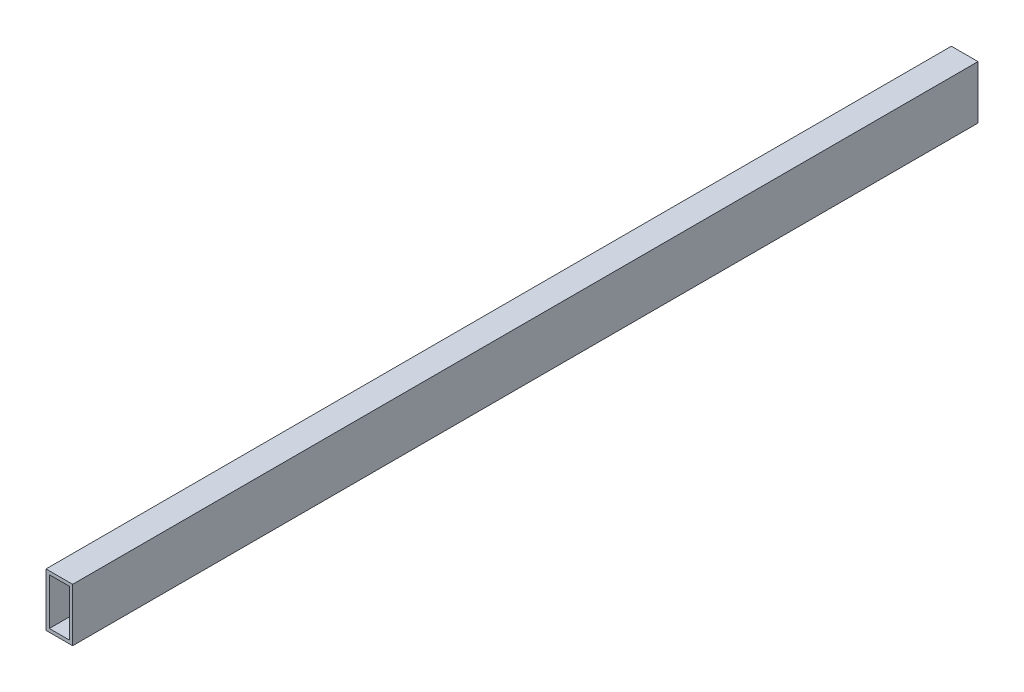
ISO-10303-21;
HEADER;
FILE_DESCRIPTION(('STEP AP214'),'2;1');
FILE_NAME('part.step','',(''),(''),'','','');
FILE_SCHEMA(('AUTOMOTIVE_DESIGN { 1 0 10303 214 1 1 1 1 }'));
ENDSEC;
DATA;
#1=APPLICATION_CONTEXT('core data for automotive mechanical design processes');
#2=APPLICATION_PROTOCOL_DEFINITION('international standard','automotive_design',2000,#1);
#3=PRODUCT_CONTEXT('',#1,'mechanical');
#4=PRODUCT('Part','Part','',(#3));
#5=PRODUCT_RELATED_PRODUCT_CATEGORY('part','',(#4));
#6=PRODUCT_DEFINITION_FORMATION('','',#4);
#7=PRODUCT_DEFINITION_CONTEXT('part definition',#1,'design');
#8=PRODUCT_DEFINITION('design','',#6,#7);
#9=PRODUCT_DEFINITION_SHAPE('','',#8);
#10=(LENGTH_UNIT() NAMED_UNIT(*) SI_UNIT(.MILLI.,.METRE.));
#11=(NAMED_UNIT(*) PLANE_ANGLE_UNIT() SI_UNIT($,.RADIAN.));
#12=(NAMED_UNIT(*) SI_UNIT($,.STERADIAN.) SOLID_ANGLE_UNIT());
#13=UNCERTAINTY_MEASURE_WITH_UNIT(LENGTH_MEASURE(1.E-05),#10,'distance_accuracy_value','');
#14=(GEOMETRIC_REPRESENTATION_CONTEXT(3) GLOBAL_UNCERTAINTY_ASSIGNED_CONTEXT((#13)) GLOBAL_UNIT_ASSIGNED_CONTEXT((#10,
#11,#12)) REPRESENTATION_CONTEXT('',''));
#15=CARTESIAN_POINT('',(0.,0.,0.));
#16=DIRECTION('',(0.,0.,1.));
#17=DIRECTION('',(1.,0.,0.));
#18=AXIS2_PLACEMENT_3D('',#15,#16,#17);
#19=CARTESIAN_POINT('',(0.,0.,431.8));
#20=DIRECTION('',(0.,0.,-1.));
#21=DIRECTION('',(-1.,0.,0.));
#22=AXIS2_PLACEMENT_3D('',#19,#20,#21);
#23=PLANE('',#22);
#24=DIRECTION('',(0.,-1.,0.));
#25=VECTOR('',#24,1.);
#26=CARTESIAN_POINT('',(0.,0.,431.8));
#27=LINE('',#26,#25);
#28=CARTESIAN_POINT('',(0.,25.4,431.8));
#29=VERTEX_POINT('',#28);
#30=CARTESIAN_POINT('',(0.,0.,431.8));
#31=VERTEX_POINT('',#30);
#32=EDGE_CURVE('E153',#29,#31,#27,.T.);
#33=ORIENTED_EDGE('',*,*,#32,.T.);
#34=DIRECTION('',(1.,0.,0.));
#35=VECTOR('',#34,1.);
#36=CARTESIAN_POINT('',(0.,0.,431.8));
#37=LINE('',#36,#35);
#38=CARTESIAN_POINT('',(12.7,0.,431.8));
#39=VERTEX_POINT('',#38);
#40=EDGE_CURVE('E157',#31,#39,#37,.T.);
#41=ORIENTED_EDGE('',*,*,#40,.T.);
#42=DIRECTION('',(0.,1.,0.));
#43=VECTOR('',#42,1.);
#44=CARTESIAN_POINT('',(12.7,0.,431.8));
#45=LINE('',#44,#43);
#46=CARTESIAN_POINT('',(12.7,25.4,431.8));
#47=VERTEX_POINT('',#46);
#48=EDGE_CURVE('E161',#39,#47,#45,.T.);
#49=ORIENTED_EDGE('',*,*,#48,.T.);
#50=DIRECTION('',(-1.,0.,0.));
#51=VECTOR('',#50,1.);
#52=CARTESIAN_POINT('',(0.,25.4,431.8));
#53=LINE('',#52,#51);
#54=EDGE_CURVE('E164',#47,#29,#53,.T.);
#55=ORIENTED_EDGE('',*,*,#54,.T.);
#56=EDGE_LOOP('',(#33,#41,#49,#55));
#57=FACE_BOUND('',#56,.T.);
#58=DIRECTION('',(0.,-1.,0.));
#59=VECTOR('',#58,1.);
#60=CARTESIAN_POINT('',(1.5875,1.5875,431.8));
#61=LINE('',#60,#59);
#62=CARTESIAN_POINT('',(1.5875,23.8125,431.8));
#63=VERTEX_POINT('',#62);
#64=CARTESIAN_POINT('',(1.5875,1.5875,431.8));
#65=VERTEX_POINT('',#64);
#66=EDGE_CURVE('E105',#63,#65,#61,.T.);
#67=ORIENTED_EDGE('',*,*,#66,.F.);
#68=DIRECTION('',(-1.,0.,0.));
#69=VECTOR('',#68,1.);
#70=CARTESIAN_POINT('',(1.5875,23.8125,431.8));
#71=LINE('',#70,#69);
#72=CARTESIAN_POINT('',(11.1125,23.8125,431.8));
#73=VERTEX_POINT('',#72);
#74=EDGE_CURVE('E131',#73,#63,#71,.T.);
#75=ORIENTED_EDGE('',*,*,#74,.F.);
#76=DIRECTION('',(0.,1.,0.));
#77=VECTOR('',#76,1.);
#78=CARTESIAN_POINT('',(11.1125,1.5875,431.8));
#79=LINE('',#78,#77);
#80=CARTESIAN_POINT('',(11.1125,1.5875,431.8));
#81=VERTEX_POINT('',#80);
#82=EDGE_CURVE('E127',#81,#73,#79,.T.);
#83=ORIENTED_EDGE('',*,*,#82,.F.);
#84=DIRECTION('',(1.,0.,0.));
#85=VECTOR('',#84,1.);
#86=CARTESIAN_POINT('',(1.5875,1.5875,431.8));
#87=LINE('',#86,#85);
#88=EDGE_CURVE('E114',#65,#81,#87,.T.);
#89=ORIENTED_EDGE('',*,*,#88,.F.);
#90=EDGE_LOOP('',(#67,#75,#83,#89));
#91=FACE_BOUND('',#90,.T.);
#92=ADVANCED_FACE('F39',(#57,#91),#23,.F.);
#93=CARTESIAN_POINT('',(0.,0.,0.));
#94=DIRECTION('',(0.,0.,-1.));
#95=DIRECTION('',(-1.,0.,0.));
#96=AXIS2_PLACEMENT_3D('',#93,#94,#95);
#97=PLANE('',#96);
#98=DIRECTION('',(0.,-1.,0.));
#99=VECTOR('',#98,1.);
#100=CARTESIAN_POINT('',(0.,0.,0.));
#101=LINE('',#100,#99);
#102=CARTESIAN_POINT('',(0.,25.4,0.));
#103=VERTEX_POINT('',#102);
#104=CARTESIAN_POINT('',(0.,0.,0.));
#105=VERTEX_POINT('',#104);
#106=EDGE_CURVE('E123',#103,#105,#101,.T.);
#107=ORIENTED_EDGE('',*,*,#106,.F.);
#108=DIRECTION('',(-1.,0.,0.));
#109=VECTOR('',#108,1.);
#110=CARTESIAN_POINT('',(0.,25.4,0.));
#111=LINE('',#110,#109);
#112=CARTESIAN_POINT('',(12.7,25.4,0.));
#113=VERTEX_POINT('',#112);
#114=EDGE_CURVE('E158',#113,#103,#111,.T.);
#115=ORIENTED_EDGE('',*,*,#114,.F.);
#116=DIRECTION('',(0.,1.,0.));
#117=VECTOR('',#116,1.);
#118=CARTESIAN_POINT('',(12.7,0.,0.));
#119=LINE('',#118,#117);
#120=CARTESIAN_POINT('',(12.7,0.,0.));
#121=VERTEX_POINT('',#120);
#122=EDGE_CURVE('E174',#121,#113,#119,.T.);
#123=ORIENTED_EDGE('',*,*,#122,.F.);
#124=DIRECTION('',(1.,0.,0.));
#125=VECTOR('',#124,1.);
#126=CARTESIAN_POINT('',(0.,0.,0.));
#127=LINE('',#126,#125);
#128=EDGE_CURVE('E171',#105,#121,#127,.T.);
#129=ORIENTED_EDGE('',*,*,#128,.F.);
#130=EDGE_LOOP('',(#107,#115,#123,#129));
#131=FACE_BOUND('',#130,.T.);
#132=DIRECTION('',(-1.,0.,0.));
#133=VECTOR('',#132,1.);
#134=CARTESIAN_POINT('',(1.5875,23.8125,0.));
#135=LINE('',#134,#133);
#136=CARTESIAN_POINT('',(11.1125,23.8125,0.));
#137=VERTEX_POINT('',#136);
#138=CARTESIAN_POINT('',(1.5875,23.8125,0.));
#139=VERTEX_POINT('',#138);
#140=EDGE_CURVE('E115',#137,#139,#135,.T.);
#141=ORIENTED_EDGE('',*,*,#140,.T.);
#142=DIRECTION('',(0.,-1.,0.));
#143=VECTOR('',#142,1.);
#144=CARTESIAN_POINT('',(1.5875,1.5875,0.));
#145=LINE('',#144,#143);
#146=CARTESIAN_POINT('',(1.5875,1.5875,0.));
#147=VERTEX_POINT('',#146);
#148=EDGE_CURVE('E63',#139,#147,#145,.T.);
#149=ORIENTED_EDGE('',*,*,#148,.T.);
#150=DIRECTION('',(1.,0.,0.));
#151=VECTOR('',#150,1.);
#152=CARTESIAN_POINT('',(1.5875,1.5875,0.));
#153=LINE('',#152,#151);
#154=CARTESIAN_POINT('',(11.1125,1.5875,0.));
#155=VERTEX_POINT('',#154);
#156=EDGE_CURVE('E121',#147,#155,#153,.T.);
#157=ORIENTED_EDGE('',*,*,#156,.T.);
#158=DIRECTION('',(0.,1.,0.));
#159=VECTOR('',#158,1.);
#160=CARTESIAN_POINT('',(11.1125,1.5875,0.));
#161=LINE('',#160,#159);
#162=EDGE_CURVE('E140',#155,#137,#161,.T.);
#163=ORIENTED_EDGE('',*,*,#162,.T.);
#164=EDGE_LOOP('',(#141,#149,#157,#163));
#165=FACE_BOUND('',#164,.T.);
#166=ADVANCED_FACE('F197',(#131,#165),#97,.T.);
#167=CARTESIAN_POINT('',(0.,0.,431.8));
#168=DIRECTION('',(1.,0.,0.));
#169=DIRECTION('',(0.,0.,-1.));
#170=AXIS2_PLACEMENT_3D('',#167,#168,#169);
#171=PLANE('',#170);
#172=ORIENTED_EDGE('',*,*,#106,.T.);
#173=DIRECTION('',(0.,0.,-1.));
#174=VECTOR('',#173,1.);
#175=CARTESIAN_POINT('',(0.,0.,431.8));
#176=LINE('',#175,#174);
#177=EDGE_CURVE('E11',#31,#105,#176,.T.);
#178=ORIENTED_EDGE('',*,*,#177,.F.);
#179=ORIENTED_EDGE('',*,*,#32,.F.);
#180=DIRECTION('',(0.,0.,-1.));
#181=VECTOR('',#180,1.);
#182=CARTESIAN_POINT('',(0.,25.4,431.8));
#183=LINE('',#182,#181);
#184=EDGE_CURVE('E167',#29,#103,#183,.T.);
#185=ORIENTED_EDGE('',*,*,#184,.T.);
#186=EDGE_LOOP('',(#172,#178,#179,#185));
#187=FACE_BOUND('',#186,.T.);
#188=ADVANCED_FACE('F41',(#187),#171,.F.);
#189=CARTESIAN_POINT('',(0.,0.,431.8));
#190=DIRECTION('',(0.,1.,0.));
#191=DIRECTION('',(0.,0.,1.));
#192=AXIS2_PLACEMENT_3D('',#189,#190,#191);
#193=PLANE('',#192);
#194=ORIENTED_EDGE('',*,*,#128,.T.);
#195=DIRECTION('',(0.,0.,-1.));
#196=VECTOR('',#195,1.);
#197=CARTESIAN_POINT('',(12.7,0.,431.8));
#198=LINE('',#197,#196);
#199=EDGE_CURVE('E48',#39,#121,#198,.T.);
#200=ORIENTED_EDGE('',*,*,#199,.F.);
#201=ORIENTED_EDGE('',*,*,#40,.F.);
#202=ORIENTED_EDGE('',*,*,#177,.T.);
#203=EDGE_LOOP('',(#194,#200,#201,#202));
#204=FACE_BOUND('',#203,.T.);
#205=ADVANCED_FACE('F207',(#204),#193,.F.);
#206=CARTESIAN_POINT('',(12.7,0.,431.8));
#207=DIRECTION('',(-1.,0.,0.));
#208=DIRECTION('',(0.,0.,1.));
#209=AXIS2_PLACEMENT_3D('',#206,#207,#208);
#210=PLANE('',#209);
#211=ORIENTED_EDGE('',*,*,#122,.T.);
#212=DIRECTION('',(0.,0.,-1.));
#213=VECTOR('',#212,1.);
#214=CARTESIAN_POINT('',(12.7,25.4,431.8));
#215=LINE('',#214,#213);
#216=EDGE_CURVE('E182',#47,#113,#215,.T.);
#217=ORIENTED_EDGE('',*,*,#216,.F.);
#218=ORIENTED_EDGE('',*,*,#48,.F.);
#219=ORIENTED_EDGE('',*,*,#199,.T.);
#220=EDGE_LOOP('',(#211,#217,#218,#219));
#221=FACE_BOUND('',#220,.T.);
#222=ADVANCED_FACE('F191',(#221),#210,.F.);
#223=CARTESIAN_POINT('',(0.,25.4,431.8));
#224=DIRECTION('',(0.,-1.,0.));
#225=DIRECTION('',(0.,0.,-1.));
#226=AXIS2_PLACEMENT_3D('',#223,#224,#225);
#227=PLANE('',#226);
#228=ORIENTED_EDGE('',*,*,#114,.T.);
#229=ORIENTED_EDGE('',*,*,#184,.F.);
#230=ORIENTED_EDGE('',*,*,#54,.F.);
#231=ORIENTED_EDGE('',*,*,#216,.T.);
#232=EDGE_LOOP('',(#228,#229,#230,#231));
#233=FACE_BOUND('',#232,.T.);
#234=ADVANCED_FACE('F201',(#233),#227,.F.);
#235=CARTESIAN_POINT('',(1.5875,1.5875,431.8));
#236=DIRECTION('',(1.,0.,0.));
#237=DIRECTION('',(0.,0.,-1.));
#238=AXIS2_PLACEMENT_3D('',#235,#236,#237);
#239=PLANE('',#238);
#240=ORIENTED_EDGE('',*,*,#148,.F.);
#241=DIRECTION('',(0.,0.,-1.));
#242=VECTOR('',#241,1.);
#243=CARTESIAN_POINT('',(1.5875,23.8125,431.8));
#244=LINE('',#243,#242);
#245=EDGE_CURVE('E109',#63,#139,#244,.T.);
#246=ORIENTED_EDGE('',*,*,#245,.F.);
#247=ORIENTED_EDGE('',*,*,#66,.T.);
#248=DIRECTION('',(0.,0.,-1.));
#249=VECTOR('',#248,1.);
#250=CARTESIAN_POINT('',(1.5875,1.5875,431.8));
#251=LINE('',#250,#249);
#252=EDGE_CURVE('E108',#65,#147,#251,.T.);
#253=ORIENTED_EDGE('',*,*,#252,.T.);
#254=EDGE_LOOP('',(#240,#246,#247,#253));
#255=FACE_BOUND('',#254,.T.);
#256=ADVANCED_FACE('F107',(#255),#239,.T.);
#257=CARTESIAN_POINT('',(1.5875,1.5875,431.8));
#258=DIRECTION('',(0.,1.,0.));
#259=DIRECTION('',(0.,0.,1.));
#260=AXIS2_PLACEMENT_3D('',#257,#258,#259);
#261=PLANE('',#260);
#262=ORIENTED_EDGE('',*,*,#156,.F.);
#263=ORIENTED_EDGE('',*,*,#252,.F.);
#264=ORIENTED_EDGE('',*,*,#88,.T.);
#265=DIRECTION('',(0.,0.,-1.));
#266=VECTOR('',#265,1.);
#267=CARTESIAN_POINT('',(11.1125,1.5875,431.8));
#268=LINE('',#267,#266);
#269=EDGE_CURVE('E124',#81,#155,#268,.T.);
#270=ORIENTED_EDGE('',*,*,#269,.T.);
#271=EDGE_LOOP('',(#262,#263,#264,#270));
#272=FACE_BOUND('',#271,.T.);
#273=ADVANCED_FACE('F118',(#272),#261,.T.);
#274=CARTESIAN_POINT('',(11.1125,1.5875,431.8));
#275=DIRECTION('',(-1.,0.,0.));
#276=DIRECTION('',(0.,0.,1.));
#277=AXIS2_PLACEMENT_3D('',#274,#275,#276);
#278=PLANE('',#277);
#279=ORIENTED_EDGE('',*,*,#162,.F.);
#280=ORIENTED_EDGE('',*,*,#269,.F.);
#281=ORIENTED_EDGE('',*,*,#82,.T.);
#282=DIRECTION('',(0.,0.,-1.));
#283=VECTOR('',#282,1.);
#284=CARTESIAN_POINT('',(11.1125,23.8125,431.8));
#285=LINE('',#284,#283);
#286=EDGE_CURVE('E55',#73,#137,#285,.T.);
#287=ORIENTED_EDGE('',*,*,#286,.T.);
#288=EDGE_LOOP('',(#279,#280,#281,#287));
#289=FACE_BOUND('',#288,.T.);
#290=ADVANCED_FACE('F230',(#289),#278,.T.);
#291=CARTESIAN_POINT('',(1.5875,23.8125,431.8));
#292=DIRECTION('',(0.,-1.,0.));
#293=DIRECTION('',(0.,0.,-1.));
#294=AXIS2_PLACEMENT_3D('',#291,#292,#293);
#295=PLANE('',#294);
#296=ORIENTED_EDGE('',*,*,#140,.F.);
#297=ORIENTED_EDGE('',*,*,#286,.F.);
#298=ORIENTED_EDGE('',*,*,#74,.T.);
#299=ORIENTED_EDGE('',*,*,#245,.T.);
#300=EDGE_LOOP('',(#296,#297,#298,#299));
#301=FACE_BOUND('',#300,.T.);
#302=ADVANCED_FACE('F234',(#301),#295,.T.);
#303=CLOSED_SHELL('',(#92,#166,#188,#205,#222,#234,#256,#273,#290,#302));
#304=MANIFOLD_SOLID_BREP('B2',#303);
#305=ADVANCED_BREP_SHAPE_REPRESENTATION('',(#18,#304),#14);
#306=SHAPE_DEFINITION_REPRESENTATION(#9,#305);
ENDSEC;
END-ISO-10303-21;
